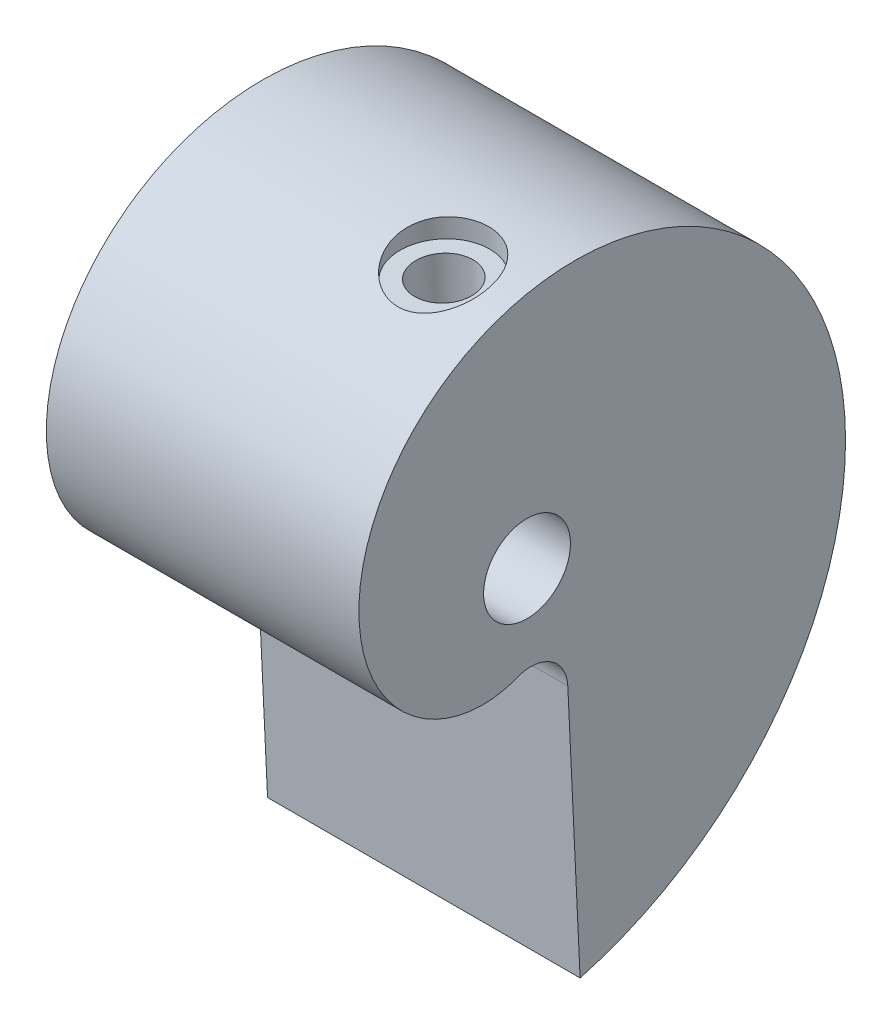
ISO-10303-21;
HEADER;
FILE_DESCRIPTION(('STEP AP214'),'2;1');
FILE_NAME('part.step','',(''),(''),'','','');
FILE_SCHEMA(('AUTOMOTIVE_DESIGN { 1 0 10303 214 1 1 1 1 }'));
ENDSEC;
DATA;
#1=APPLICATION_CONTEXT('core data for automotive mechanical design processes');
#2=APPLICATION_PROTOCOL_DEFINITION('international standard','automotive_design',2000,#1);
#3=PRODUCT_CONTEXT('',#1,'mechanical');
#4=PRODUCT('Part','Part','',(#3));
#5=PRODUCT_RELATED_PRODUCT_CATEGORY('part','',(#4));
#6=PRODUCT_DEFINITION_FORMATION('','',#4);
#7=PRODUCT_DEFINITION_CONTEXT('part definition',#1,'design');
#8=PRODUCT_DEFINITION('design','',#6,#7);
#9=PRODUCT_DEFINITION_SHAPE('','',#8);
#10=(LENGTH_UNIT() NAMED_UNIT(*) SI_UNIT(.MILLI.,.METRE.));
#11=(NAMED_UNIT(*) PLANE_ANGLE_UNIT() SI_UNIT($,.RADIAN.));
#12=(NAMED_UNIT(*) SI_UNIT($,.STERADIAN.) SOLID_ANGLE_UNIT());
#13=UNCERTAINTY_MEASURE_WITH_UNIT(LENGTH_MEASURE(1.E-05),#10,'distance_accuracy_value','');
#14=(GEOMETRIC_REPRESENTATION_CONTEXT(3) GLOBAL_UNCERTAINTY_ASSIGNED_CONTEXT((#13)) GLOBAL_UNIT_ASSIGNED_CONTEXT((#10,
#11,#12)) REPRESENTATION_CONTEXT('',''));
#15=CARTESIAN_POINT('',(0.,0.,0.));
#16=DIRECTION('',(0.,0.,1.));
#17=DIRECTION('',(1.,0.,0.));
#18=AXIS2_PLACEMENT_3D('',#15,#16,#17);
#19=CARTESIAN_POINT('',(21.59,16.3980040897592,0.208936694079273));
#20=DIRECTION('',(1.,0.,0.));
#21=DIRECTION('',(0.,0.,-1.));
#22=AXIS2_PLACEMENT_3D('',#19,#20,#21);
#23=PLANE('',#22);
#24=CARTESIAN_POINT('',(21.59,-26.3254834999288,-3.66701312597946));
#25=CARTESIAN_POINT('',(21.59,-25.8850164099486,-5.29183143138332));
#26=CARTESIAN_POINT('',(21.59,-25.2937709802203,-6.85500985861185));
#27=CARTESIAN_POINT('',(21.59,-23.8451939849136,-9.80629411018198));
#28=CARTESIAN_POINT('',(21.59,-22.9879265697091,-11.1943493778112));
#29=CARTESIAN_POINT('',(21.59,-21.0514010056648,-13.7523524342122));
#30=CARTESIAN_POINT('',(21.59,-19.9722145165317,-14.9222640436458));
#31=CARTESIAN_POINT('',(21.59,-17.6424148443339,-17.0111362692066));
#32=CARTESIAN_POINT('',(21.59,-16.3918777440894,-17.9300760548234));
#33=CARTESIAN_POINT('',(21.59,-13.774181132005,-19.4952108297215));
#34=CARTESIAN_POINT('',(21.59,-12.4070989510175,-20.1414006679111));
#35=CARTESIAN_POINT('',(21.59,-9.61304301680638,-21.1506818581234));
#36=CARTESIAN_POINT('',(21.59,-8.18614470800054,-21.5137834309209));
#37=CARTESIAN_POINT('',(21.59,-5.3288100875924,-21.9578966574969));
#38=CARTESIAN_POINT('',(21.59,-3.8984443651538,-22.038932986476));
#39=CARTESIAN_POINT('',(21.59,-1.08794928189315,-21.9307589450492));
#40=CARTESIAN_POINT('',(21.59,0.292117032528461,-21.7415862291151));
#41=CARTESIAN_POINT('',(21.59,2.95283289615589,-21.1147307327981));
#42=CARTESIAN_POINT('',(21.59,4.23342924609723,-20.6770966268396));
#43=CARTESIAN_POINT('',(21.59,6.65237105198453,-19.5836453555955));
#44=CARTESIAN_POINT('',(21.59,7.79067499289227,-18.9278855327687));
#45=CARTESIAN_POINT('',(21.59,9.88997156551444,-17.4355003933537));
#46=CARTESIAN_POINT('',(21.59,10.8509356728284,-16.5989384482919));
#47=CARTESIAN_POINT('',(21.59,12.5693210600784,-14.7874359048066));
#48=CARTESIAN_POINT('',(21.59,13.3267275415238,-13.8125618959728));
#49=CARTESIAN_POINT('',(21.59,14.6212472227952,-11.7701307863269));
#50=CARTESIAN_POINT('',(21.59,15.1583594978757,-10.7026406297588));
#51=CARTESIAN_POINT('',(21.59,16.0052572395325,-8.52186727257846));
#52=CARTESIAN_POINT('',(21.59,16.3150552236039,-7.40864857435838));
#53=CARTESIAN_POINT('',(21.59,16.7098316537026,-5.1825201174866));
#54=CARTESIAN_POINT('',(21.59,16.7948350803545,-4.06966980389498));
#55=CARTESIAN_POINT('',(21.59,16.7515036458065,-1.88772278855217));
#56=CARTESIAN_POINT('',(21.59,16.6232047553048,-0.818678144435623));
#57=CARTESIAN_POINT('',(21.59,16.1728034242135,1.23655153259428));
#58=CARTESIAN_POINT('',(21.59,15.8507460504129,2.22269384951727));
#59=CARTESIAN_POINT('',(21.59,15.0391926205608,4.07878041726697));
#60=CARTESIAN_POINT('',(21.59,14.5497485015278,4.94869279896394));
#61=CARTESIAN_POINT('',(21.59,13.4351525169527,6.5458728071125));
#62=CARTESIAN_POINT('',(21.59,12.8100570020662,7.27312041446994));
#63=CARTESIAN_POINT('',(21.59,11.4596211058448,8.56619770795014));
#64=CARTESIAN_POINT('',(21.59,10.7343389103516,9.13201969506656));
#65=CARTESIAN_POINT('',(21.59,8.46432492032774,10.5713349527582));
#66=CARTESIAN_POINT('',(21.59,6.82631034463374,11.1827796887629));
#67=CARTESIAN_POINT('',(21.59,3.59680348317033,11.7204279571445));
#68=CARTESIAN_POINT('',(21.59,2.00685947245538,11.6474809761802));
#69=CARTESIAN_POINT('',(21.59,-0.874358563474903,10.9424993264994));
#70=CARTESIAN_POINT('',(21.59,-2.16461256267651,10.3118298030999));
#71=CARTESIAN_POINT('',(21.59,-4.28109326467022,8.69840573541426));
#72=CARTESIAN_POINT('',(21.59,-5.10697539238301,7.71726162806799));
#73=CARTESIAN_POINT('',(21.59,-6.23707693613607,5.64499605846387));
#74=CARTESIAN_POINT('',(21.59,-6.54165034000696,4.55542957813348));
#75=CARTESIAN_POINT('',(21.59,-6.67904709626705,2.49487199667444));
#76=CARTESIAN_POINT('',(21.59,-6.51282232630776,1.52510200770759));
#77=CARTESIAN_POINT('',(21.59,-6.17940617515592,0.700777065763977));
#78=B_SPLINE_CURVE_WITH_KNOTS('',3,(#24,#25,#26,#27,#28,#29,#30,#31,#32,#33,#34,#35,#36,#37,#38,
#39,#40,#41,#42,#43,#44,#45,#46,#47,#48,#49,#50,#51,#52,#53,#54,#55,#56,#57,#58,#59,#60,#61,#62,
#63,#64,#65,#66,#67,#68,#69,#70,#71,#72,#73,#74,#75,#76,#77),.UNSPECIFIED.,.F.,.F.,(4,2,2,2,2,2,
2,2,2,2,2,2,2,2,2,2,2,2,2,2,2,2,2,2,2,2,4),(0.,0.0312500000000001,0.0625000000000001,
0.0937500000000002,0.125,0.15625,0.1875,0.218750000000001,0.250000000000001,0.281250000000001,
0.312500000000001,0.343750000000001,0.375000000000001,0.406250000000001,0.437500000000001,
0.468750000000001,0.500000000000001,0.53125,0.5625,0.59375,0.625,0.6875,0.75,0.8125,0.875,
0.9375,1.),.UNSPECIFIED.);
#79=CARTESIAN_POINT('',(21.59,-26.3254834999288,-3.66701312597946));
#80=VERTEX_POINT('',#79);
#81=CARTESIAN_POINT('',(21.59,-6.17940617515592,0.700777065763977));
#82=VERTEX_POINT('',#81);
#83=EDGE_CURVE('E98',#80,#82,#78,.T.);
#84=ORIENTED_EDGE('',*,*,#83,.T.);
#85=CARTESIAN_POINT('',(21.59,-8.55278837318837,-0.259188983321581));
#86=DIRECTION('',(-1.,0.,0.));
#87=DIRECTION('',(0.,0.,-1.));
#88=AXIS2_PLACEMENT_3D('',#85,#86,#87);
#89=CIRCLE('',#88,2.56017145389411);
#90=CARTESIAN_POINT('',(21.59,-8.4312368938815,-2.81647330682036));
#91=VERTEX_POINT('',#90);
#92=EDGE_CURVE('E94',#82,#91,#89,.T.);
#93=ORIENTED_EDGE('',*,*,#92,.T.);
#94=DIRECTION('',(0.,-0.998872290216758,-0.0474778668131734));
#95=VECTOR('',#94,1.);
#96=CARTESIAN_POINT('',(21.59,-26.3254834999288,-3.66701312597946));
#97=LINE('',#96,#95);
#98=EDGE_CURVE('E74',#91,#80,#97,.T.);
#99=ORIENTED_EDGE('',*,*,#98,.T.);
#100=EDGE_LOOP('',(#84,#93,#99));
#101=FACE_BOUND('',#100,.T.);
#102=CARTESIAN_POINT('',(21.59,0.,0.));
#103=DIRECTION('',(1.,0.,0.));
#104=DIRECTION('',(0.,0.,-1.));
#105=AXIS2_PLACEMENT_3D('',#102,#103,#104);
#106=CIRCLE('',#105,3.);
#107=CARTESIAN_POINT('',(21.59,0.,-3.));
#108=VERTEX_POINT('',#107);
#109=EDGE_CURVE('E107',#108,#108,#106,.T.);
#110=ORIENTED_EDGE('',*,*,#109,.F.);
#111=EDGE_LOOP('',(#110));
#112=FACE_BOUND('',#111,.T.);
#113=ADVANCED_FACE('F49',(#101,#112),#23,.T.);
#114=CARTESIAN_POINT('',(0.,16.3980040897592,0.208936694079273));
#115=DIRECTION('',(1.,0.,0.));
#116=DIRECTION('',(0.,0.,-1.));
#117=AXIS2_PLACEMENT_3D('',#114,#115,#116);
#118=PLANE('',#117);
#119=CARTESIAN_POINT('',(0.,-26.3254834999288,-3.66701312597946));
#120=CARTESIAN_POINT('',(0.,-25.8850164099486,-5.29183143138332));
#121=CARTESIAN_POINT('',(0.,-25.2937709802203,-6.85500985861185));
#122=CARTESIAN_POINT('',(0.,-23.8451939849136,-9.80629411018198));
#123=CARTESIAN_POINT('',(0.,-22.9879265697091,-11.1943493778112));
#124=CARTESIAN_POINT('',(0.,-21.0514010056648,-13.7523524342122));
#125=CARTESIAN_POINT('',(0.,-19.9722145165317,-14.9222640436458));
#126=CARTESIAN_POINT('',(0.,-17.6424148443339,-17.0111362692066));
#127=CARTESIAN_POINT('',(0.,-16.3918777440894,-17.9300760548234));
#128=CARTESIAN_POINT('',(0.,-13.774181132005,-19.4952108297215));
#129=CARTESIAN_POINT('',(0.,-12.4070989510175,-20.1414006679111));
#130=CARTESIAN_POINT('',(0.,-9.61304301680638,-21.1506818581234));
#131=CARTESIAN_POINT('',(0.,-8.18614470800054,-21.5137834309209));
#132=CARTESIAN_POINT('',(0.,-5.3288100875924,-21.9578966574969));
#133=CARTESIAN_POINT('',(0.,-3.8984443651538,-22.038932986476));
#134=CARTESIAN_POINT('',(0.,-1.08794928189315,-21.9307589450492));
#135=CARTESIAN_POINT('',(0.,0.292117032528461,-21.7415862291151));
#136=CARTESIAN_POINT('',(0.,2.95283289615589,-21.1147307327981));
#137=CARTESIAN_POINT('',(0.,4.23342924609723,-20.6770966268396));
#138=CARTESIAN_POINT('',(0.,6.65237105198453,-19.5836453555955));
#139=CARTESIAN_POINT('',(0.,7.79067499289227,-18.9278855327687));
#140=CARTESIAN_POINT('',(0.,9.88997156551444,-17.4355003933537));
#141=CARTESIAN_POINT('',(0.,10.8509356728284,-16.5989384482919));
#142=CARTESIAN_POINT('',(0.,12.5693210600784,-14.7874359048066));
#143=CARTESIAN_POINT('',(0.,13.3267275415238,-13.8125618959728));
#144=CARTESIAN_POINT('',(0.,14.6212472227952,-11.7701307863269));
#145=CARTESIAN_POINT('',(0.,15.1583594978757,-10.7026406297588));
#146=CARTESIAN_POINT('',(0.,16.0052572395325,-8.52186727257846));
#147=CARTESIAN_POINT('',(0.,16.3150552236039,-7.40864857435838));
#148=CARTESIAN_POINT('',(0.,16.7098316537026,-5.1825201174866));
#149=CARTESIAN_POINT('',(0.,16.7948350803545,-4.06966980389498));
#150=CARTESIAN_POINT('',(0.,16.7515036458065,-1.88772278855217));
#151=CARTESIAN_POINT('',(0.,16.6232047553048,-0.818678144435623));
#152=CARTESIAN_POINT('',(0.,16.1728034242135,1.23655153259428));
#153=CARTESIAN_POINT('',(0.,15.8507460504129,2.22269384951727));
#154=CARTESIAN_POINT('',(0.,15.0391926205608,4.07878041726697));
#155=CARTESIAN_POINT('',(0.,14.5497485015278,4.94869279896394));
#156=CARTESIAN_POINT('',(0.,13.4351525169527,6.5458728071125));
#157=CARTESIAN_POINT('',(0.,12.8100570020662,7.27312041446994));
#158=CARTESIAN_POINT('',(0.,11.4596211058448,8.56619770795014));
#159=CARTESIAN_POINT('',(0.,10.7343389103516,9.13201969506656));
#160=CARTESIAN_POINT('',(0.,8.46432492032774,10.5713349527582));
#161=CARTESIAN_POINT('',(0.,6.82631034463374,11.1827796887629));
#162=CARTESIAN_POINT('',(0.,3.59680348317033,11.7204279571445));
#163=CARTESIAN_POINT('',(0.,2.00685947245538,11.6474809761802));
#164=CARTESIAN_POINT('',(0.,-0.874358563474903,10.9424993264994));
#165=CARTESIAN_POINT('',(0.,-2.16461256267651,10.3118298030999));
#166=CARTESIAN_POINT('',(0.,-4.28109326467022,8.69840573541426));
#167=CARTESIAN_POINT('',(0.,-5.10697539238301,7.71726162806799));
#168=CARTESIAN_POINT('',(0.,-6.23707693613607,5.64499605846387));
#169=CARTESIAN_POINT('',(0.,-6.54165034000696,4.55542957813348));
#170=CARTESIAN_POINT('',(0.,-6.67904709626705,2.49487199667444));
#171=CARTESIAN_POINT('',(0.,-6.51282232630776,1.52510200770759));
#172=CARTESIAN_POINT('',(0.,-6.17940617515592,0.700777065763977));
#173=B_SPLINE_CURVE_WITH_KNOTS('',3,(#119,#120,#121,#122,#123,#124,#125,#126,#127,#128,#129,
#130,#131,#132,#133,#134,#135,#136,#137,#138,#139,#140,#141,#142,#143,#144,#145,#146,#147,#148,
#149,#150,#151,#152,#153,#154,#155,#156,#157,#158,#159,#160,#161,#162,#163,#164,#165,#166,#167,
#168,#169,#170,#171,#172),.UNSPECIFIED.,.F.,.F.,(4,2,2,2,2,2,2,2,2,2,2,2,2,2,2,2,2,2,2,2,2,2,2,
2,2,2,4),(0.,0.0312500000000001,0.0625000000000001,0.0937500000000002,0.125,0.15625,0.1875,
0.218750000000001,0.250000000000001,0.281250000000001,0.312500000000001,0.343750000000001,
0.375000000000001,0.406250000000001,0.437500000000001,0.468750000000001,0.500000000000001,
0.53125,0.5625,0.59375,0.625,0.6875,0.75,0.8125,0.875,0.9375,1.),.UNSPECIFIED.);
#174=CARTESIAN_POINT('',(0.,-26.3254834999288,-3.66701312597946));
#175=VERTEX_POINT('',#174);
#176=CARTESIAN_POINT('',(0.,-6.17940617515592,0.700777065763977));
#177=VERTEX_POINT('',#176);
#178=EDGE_CURVE('E104',#175,#177,#173,.T.);
#179=ORIENTED_EDGE('',*,*,#178,.F.);
#180=DIRECTION('',(0.,-0.998872290216758,-0.0474778668131734));
#181=VECTOR('',#180,1.);
#182=CARTESIAN_POINT('',(0.,-26.3254834999288,-3.66701312597946));
#183=LINE('',#182,#181);
#184=CARTESIAN_POINT('',(0.,-8.4312368938815,-2.81647330682036));
#185=VERTEX_POINT('',#184);
#186=EDGE_CURVE('E91',#185,#175,#183,.T.);
#187=ORIENTED_EDGE('',*,*,#186,.F.);
#188=CARTESIAN_POINT('',(0.,-8.55278837318837,-0.259188983321581));
#189=DIRECTION('',(-1.,0.,0.));
#190=DIRECTION('',(0.,0.,-1.));
#191=AXIS2_PLACEMENT_3D('',#188,#189,#190);
#192=CIRCLE('',#191,2.56017145389411);
#193=EDGE_CURVE('E86',#177,#185,#192,.T.);
#194=ORIENTED_EDGE('',*,*,#193,.F.);
#195=EDGE_LOOP('',(#179,#187,#194));
#196=FACE_BOUND('',#195,.T.);
#197=CARTESIAN_POINT('',(0.,0.,0.));
#198=DIRECTION('',(1.,0.,0.));
#199=DIRECTION('',(0.,0.,-1.));
#200=AXIS2_PLACEMENT_3D('',#197,#198,#199);
#201=CIRCLE('',#200,3.);
#202=CARTESIAN_POINT('',(0.,0.,-3.));
#203=VERTEX_POINT('',#202);
#204=EDGE_CURVE('E111',#203,#203,#201,.T.);
#205=ORIENTED_EDGE('',*,*,#204,.T.);
#206=EDGE_LOOP('',(#205));
#207=FACE_BOUND('',#206,.T.);
#208=ADVANCED_FACE('F142',(#196,#207),#118,.F.);
#209=DIRECTION('',(-1.,0.,0.));
#210=VECTOR('',#209,1.);
#211=SURFACE_OF_LINEAR_EXTRUSION('',#78,#210);
#212=CARTESIAN_POINT('',(16.565,16.7506396740937,-2.38240201858189));
#213=CARTESIAN_POINT('',(16.7433125657749,16.7506413895993,-2.38239572343409));
#214=CARTESIAN_POINT('',(16.9217084574211,16.749821870359,-2.36735698221768));
#215=CARTESIAN_POINT('',(17.2735404531971,16.7463257784659,-2.30760094349494));
#216=CARTESIAN_POINT('',(17.4469725353157,16.7436477419284,-2.26286025207603));
#217=CARTESIAN_POINT('',(17.7838175619757,16.7358008377302,-2.14500470832748));
#218=CARTESIAN_POINT('',(17.9472329710051,16.7306325855541,-2.07189686812296));
#219=CARTESIAN_POINT('',(18.2593967109722,16.7168613322798,-1.89946022909936));
#220=CARTESIAN_POINT('',(18.4081474456539,16.7082588952634,-1.80013573740177));
#221=CARTESIAN_POINT('',(18.6865194273289,16.6865245866847,-1.57839471352308));
#222=CARTESIAN_POINT('',(18.816172777858,16.6734004432769,-1.45601774158622));
#223=CARTESIAN_POINT('',(19.0529395131531,16.6415294219983,-1.19174783860988));
#224=CARTESIAN_POINT('',(19.1600538561791,16.6227827832536,-1.04985573769259));
#225=CARTESIAN_POINT('',(19.348142330831,16.5789328491663,-0.751848833363511));
#226=CARTESIAN_POINT('',(19.4292768024721,16.5538703203621,-0.595829205294695));
#227=CARTESIAN_POINT('',(19.5642185684297,16.4968714939526,-0.273578315973267));
#228=CARTESIAN_POINT('',(19.6180270069779,16.4649354842426,-0.107347482624563));
#229=CARTESIAN_POINT('',(19.6971716405541,16.394258927079,0.23027529592253));
#230=CARTESIAN_POINT('',(19.722518372012,16.3555209038536,0.401665307067589));
#231=CARTESIAN_POINT('',(19.744621054064,16.2718922700363,0.74477200769912));
#232=CARTESIAN_POINT('',(19.7413740122333,16.2270010159743,0.916488729496723));
#233=CARTESIAN_POINT('',(19.7065779354297,16.131231758128,1.25944455369324));
#234=CARTESIAN_POINT('',(19.6744043268891,16.0802432751121,1.43058903606567));
#235=CARTESIAN_POINT('',(19.5822767862168,15.9748963486612,1.76413828861456));
#236=CARTESIAN_POINT('',(19.5223164634281,15.9205371324849,1.92654103868751));
#237=CARTESIAN_POINT('',(19.37349122948,15.8084495214842,2.24504073687003));
#238=CARTESIAN_POINT('',(19.2835681169074,15.7506732515505,2.40062724447312));
#239=CARTESIAN_POINT('',(19.0779746661179,15.6367051121502,2.69441582491913));
#240=CARTESIAN_POINT('',(18.9622977115638,15.5805136540196,2.83261341612553));
#241=CARTESIAN_POINT('',(18.7052597507176,15.4718331439367,3.09055875271198));
#242=CARTESIAN_POINT('',(18.563448220764,15.4194359017119,3.20990127896187));
#243=CARTESIAN_POINT('',(18.3354405886196,15.3473231379403,3.3696794962394));
#244=CARTESIAN_POINT('',(18.2568465828785,15.324356219765,3.419753165804));
#245=CARTESIAN_POINT('',(18.0950375543645,15.2810258558235,3.51306824531798));
#246=CARTESIAN_POINT('',(18.0118248362869,15.2606611280454,3.55631302212939));
#247=CARTESIAN_POINT('',(17.8449506674736,15.2237661173167,3.63386819559383));
#248=CARTESIAN_POINT('',(17.7614559986682,15.2071103843645,3.66847836816939));
#249=CARTESIAN_POINT('',(17.5913768396874,15.1769484403086,3.73067224852883));
#250=CARTESIAN_POINT('',(17.5047938330402,15.1634407398821,3.75825927950836));
#251=CARTESIAN_POINT('',(17.3291969657523,15.1398794833412,3.80610837444833));
#252=CARTESIAN_POINT('',(17.2401839282174,15.1298247729152,3.82637288639648));
#253=CARTESIAN_POINT('',(17.0604349726318,15.113407621694,3.85934439959767));
#254=CARTESIAN_POINT('',(16.9696991833952,15.1070449059538,3.87205196362262));
#255=CARTESIAN_POINT('',(16.79455331826,15.0985240892335,3.88904578045354));
#256=CARTESIAN_POINT('',(16.7102142050666,15.0960717840662,3.89392151576271));
#257=CARTESIAN_POINT('',(16.5413523279664,15.0944819837441,3.89708380613252));
#258=CARTESIAN_POINT('',(16.4568295124437,15.0953455878203,3.89536817614142));
#259=CARTESIAN_POINT('',(16.2883132554156,15.1003719089667,3.88536114739973));
#260=CARTESIAN_POINT('',(16.2043195602008,15.1045329006177,3.87707318774104));
#261=CARTESIAN_POINT('',(16.0374380848698,15.1160570440926,3.85402351718646));
#262=CARTESIAN_POINT('',(15.9545507303056,15.1234213934655,3.83925938520938));
#263=CARTESIAN_POINT('',(15.7135282259701,15.1495616401689,3.78655914799319));
#264=CARTESIAN_POINT('',(15.5576580863421,15.1725644974324,3.73987333526958));
#265=CARTESIAN_POINT('',(15.2563374938122,15.2283883617697,3.6243856032296));
#266=CARTESIAN_POINT('',(15.1108890695337,15.2612112739511,3.55557939232458));
#267=CARTESIAN_POINT('',(14.8265360489511,15.3363613688962,3.39404776600376));
#268=CARTESIAN_POINT('',(14.6883111815686,15.3790784167601,3.30030741267247));
#269=CARTESIAN_POINT('',(14.4294546693891,15.4703504029779,3.09340467821784));
#270=CARTESIAN_POINT('',(14.3088294301683,15.5189074551929,2.98023525813181));
#271=CARTESIAN_POINT('',(14.0789724060991,15.6231462990422,2.72781772189997));
#272=CARTESIAN_POINT('',(13.9713199073631,15.6790889471381,2.58723636566584));
#273=CARTESIAN_POINT('',(13.7815053033552,15.7918180971415,2.29008118723744));
#274=CARTESIAN_POINT('',(13.6993495787082,15.8486048065575,2.13350337490384));
#275=CARTESIAN_POINT('',(13.5602533042469,15.9623970325448,1.80219910865936));
#276=CARTESIAN_POINT('',(13.504326409703,16.0193369007987,1.62702235329759));
#277=CARTESIAN_POINT('',(13.4242595372715,16.1287696936005,1.26820289867208));
#278=CARTESIAN_POINT('',(13.4001155032531,16.1812631847952,1.0845612827911));
#279=CARTESIAN_POINT('',(13.385193870193,16.2787719932153,0.718254653214319));
#280=CARTESIAN_POINT('',(13.3936966228172,16.3239259866846,0.53565643838068));
#281=CARTESIAN_POINT('',(13.4429083099938,16.4069046087537,0.173155051099132));
#282=CARTESIAN_POINT('',(13.4836093005975,16.4447310423436,-0.00674877495434841));
#283=CARTESIAN_POINT('',(13.5942352875637,16.5112585207308,-0.350944470852365));
#284=CARTESIAN_POINT('',(13.662934134937,16.540262566406,-0.515572664111018));
#285=CARTESIAN_POINT('',(13.8276352586509,16.5913323509495,-0.831717074035169));
#286=CARTESIAN_POINT('',(13.9236341626166,16.6133989460922,-0.983234907209561));
#287=CARTESIAN_POINT('',(14.1382408076017,16.6509650936835,-1.26576374035269));
#288=CARTESIAN_POINT('',(14.2564004615726,16.6665779170517,-1.39710052998256));
#289=CARTESIAN_POINT('',(14.5131439312932,16.692803887894,-1.63864995249749));
#290=CARTESIAN_POINT('',(14.6517311068004,16.7034162117182,-1.74885910360258));
#291=CARTESIAN_POINT('',(14.9458446839421,16.7207600224453,-1.9451849781874));
#292=CARTESIAN_POINT('',(15.1014212227302,16.7274796324812,-2.03122756112737));
#293=CARTESIAN_POINT('',(15.4247138575761,16.7380174528368,-2.17622583051713));
#294=CARTESIAN_POINT('',(15.592420784005,16.7418378301567,-2.23520173460522));
#295=CARTESIAN_POINT('',(15.8944508944589,16.7467084225449,-2.31383530128008));
#296=CARTESIAN_POINT('',(16.0272363012907,16.7482011961144,-2.33950607055206));
#297=CARTESIAN_POINT('',(16.2949985372011,16.7501661752923,-2.37379186153075));
#298=CARTESIAN_POINT('',(16.429975378834,16.7506383750518,-2.38240678549186));
#299=CARTESIAN_POINT('',(16.565,16.7506396740937,-2.38240201858189));
#300=B_SPLINE_CURVE_WITH_KNOTS('',3,(#212,#213,#214,#215,#216,#217,#218,#219,#220,#221,#222,
#223,#224,#225,#226,#227,#228,#229,#230,#231,#232,#233,#234,#235,#236,#237,#238,#239,#240,#241,
#242,#243,#244,#245,#246,#247,#248,#249,#250,#251,#252,#253,#254,#255,#256,#257,#258,#259,#260,
#261,#262,#263,#264,#265,#266,#267,#268,#269,#270,#271,#272,#273,#274,#275,#276,#277,#278,#279,
#280,#281,#282,#283,#284,#285,#286,#287,#288,#289,#290,#291,#292,#293,#294,#295,#296,#297,#298,
#299),.UNSPECIFIED.,.T.,.F.,(4,2,2,2,2,2,2,2,2,2,2,2,2,2,2,2,2,2,2,2,2,2,2,2,2,2,2,2,2,2,2,2,2,
2,2,2,2,2,2,2,2,2,2,4),(0.,0.534451645894367,1.06932473792822,1.60406569789057,2.13871886013215,
2.67246273028415,3.2061839033957,3.73654461265796,4.26688311212229,4.79702521723493,
5.32722280398093,5.86915066299671,6.41120322172103,6.97489189795413,7.5387255570959,
8.11338569897889,8.40100316382573,8.6884783783365,8.96383534701767,9.23906177966751,
9.51419611619283,9.78930996067973,10.0425392195921,10.295852431789,10.5490331806023,
10.8023086604135,11.2929022099079,11.7835909971805,12.2985553916675,12.8137067479945,
13.3682975128205,13.9230269535227,14.497716588367,15.0723328741687,15.6343561150362,
16.1962407367653,16.7357872484509,17.2752671389078,17.8048292042514,18.3344784651681,
18.8657353155608,19.3965946916137,19.8012981803549,20.2060039884107),.UNSPECIFIED.);
#301=CARTESIAN_POINT('',(16.565,16.7506396740937,-2.38240201858189));
#302=VERTEX_POINT('',#301);
#303=EDGE_CURVE('E122',#302,#302,#300,.T.);
#304=ORIENTED_EDGE('',*,*,#303,.T.);
#305=EDGE_LOOP('',(#304));
#306=FACE_BOUND('',#305,.T.);
#307=ORIENTED_EDGE('',*,*,#178,.T.);
#308=DIRECTION('',(-1.,0.,0.));
#309=VECTOR('',#308,1.);
#310=CARTESIAN_POINT('',(21.59,-6.17940617515592,0.700777065763977));
#311=LINE('',#310,#309);
#312=EDGE_CURVE('E13',#82,#177,#311,.T.);
#313=ORIENTED_EDGE('',*,*,#312,.F.);
#314=ORIENTED_EDGE('',*,*,#83,.F.);
#315=DIRECTION('',(-1.,0.,0.));
#316=VECTOR('',#315,1.);
#317=CARTESIAN_POINT('',(21.59,-26.3254834999288,-3.66701312597946));
#318=LINE('',#317,#316);
#319=EDGE_CURVE('E105',#80,#175,#318,.T.);
#320=ORIENTED_EDGE('',*,*,#319,.T.);
#321=EDGE_LOOP('',(#307,#313,#314,#320));
#322=FACE_BOUND('',#321,.T.);
#323=ADVANCED_FACE('F51',(#306,#322),#211,.F.);
#324=CARTESIAN_POINT('',(21.59,-8.55278837318837,-0.259188983321581));
#325=DIRECTION('',(-1.,0.,0.));
#326=DIRECTION('',(0.,0.,1.));
#327=AXIS2_PLACEMENT_3D('',#324,#325,#326);
#328=CYLINDRICAL_SURFACE('',#327,2.56017145389411);
#329=ORIENTED_EDGE('',*,*,#193,.T.);
#330=DIRECTION('',(-1.,0.,0.));
#331=VECTOR('',#330,1.);
#332=CARTESIAN_POINT('',(21.59,-8.4312368938815,-2.81647330682036));
#333=LINE('',#332,#331);
#334=EDGE_CURVE('E65',#91,#185,#333,.T.);
#335=ORIENTED_EDGE('',*,*,#334,.F.);
#336=ORIENTED_EDGE('',*,*,#92,.F.);
#337=ORIENTED_EDGE('',*,*,#312,.T.);
#338=EDGE_LOOP('',(#329,#335,#336,#337));
#339=FACE_BOUND('',#338,.T.);
#340=ADVANCED_FACE('F95',(#339),#328,.F.);
#341=CARTESIAN_POINT('',(21.59,-26.3254834999288,-3.66701312597946));
#342=DIRECTION('',(0.,0.0474778668131734,-0.998872290216758));
#343=DIRECTION('',(0.,0.998872290216758,0.0474778668131734));
#344=AXIS2_PLACEMENT_3D('',#341,#342,#343);
#345=PLANE('',#344);
#346=ORIENTED_EDGE('',*,*,#186,.T.);
#347=ORIENTED_EDGE('',*,*,#319,.F.);
#348=ORIENTED_EDGE('',*,*,#98,.F.);
#349=ORIENTED_EDGE('',*,*,#334,.T.);
#350=EDGE_LOOP('',(#346,#347,#348,#349));
#351=FACE_BOUND('',#350,.T.);
#352=ADVANCED_FACE('F138',(#351),#345,.F.);
#353=CARTESIAN_POINT('',(21.59,0.,0.));
#354=DIRECTION('',(-1.,0.,0.));
#355=DIRECTION('',(0.,0.,1.));
#356=AXIS2_PLACEMENT_3D('',#353,#354,#355);
#357=CYLINDRICAL_SURFACE('',#356,3.);
#358=CARTESIAN_POINT('',(16.565,2.12028038204539,2.12235979549027));
#359=CARTESIAN_POINT('',(16.4667328598408,2.12028848918387,2.12235574640076));
#360=CARTESIAN_POINT('',(16.3684396592825,2.1272670071276,2.11544854411303));
#361=CARTESIAN_POINT('',(16.1753956042412,2.15382911691391,2.08838492945829));
#362=CARTESIAN_POINT('',(16.0806515368345,2.17343567338187,2.06820437751953));
#363=CARTESIAN_POINT('',(15.898115540295,2.22182310173142,2.01611940184166));
#364=CARTESIAN_POINT('',(15.8102646347584,2.25051228608712,1.98433167860404));
#365=CARTESIAN_POINT('',(15.641517994946,2.31379446378661,1.91016493745002));
#366=CARTESIAN_POINT('',(15.5606235348317,2.34838853523675,1.86778398477872));
#367=CARTESIAN_POINT('',(15.3939764145017,2.42634419581015,1.76567376420376));
#368=CARTESIAN_POINT('',(15.3095005764119,2.47022479874889,1.70425677328391));
#369=CARTESIAN_POINT('',(15.1512681262757,2.55831415648357,1.56893677481746));
#370=CARTESIAN_POINT('',(15.0775234546584,2.60252322014981,1.49502005366528));
#371=CARTESIAN_POINT('',(14.9319381685596,2.69434111659312,1.32338517364023));
#372=CARTESIAN_POINT('',(14.8620133455484,2.74147712399974,1.22376200962438));
#373=CARTESIAN_POINT('',(14.74092456293,2.82705144975862,1.01040221396569));
#374=CARTESIAN_POINT('',(14.6897263388148,2.86550560364039,0.896691873719948));
#375=CARTESIAN_POINT('',(14.6194406320562,2.92138993541408,0.688486460837517));
#376=CARTESIAN_POINT('',(14.5955107790667,2.94167661806749,0.596380838870983));
#377=CARTESIAN_POINT('',(14.5610706488714,2.97361755963886,0.408255826934818));
#378=CARTESIAN_POINT('',(14.5505501907331,2.9852783648312,0.312239463380161));
#379=CARTESIAN_POINT('',(14.5435070950218,2.99921453700448,0.118857670982175));
#380=CARTESIAN_POINT('',(14.5470072123757,3.00147463482578,0.0214903048783748));
#381=CARTESIAN_POINT('',(14.5678489053777,2.99664936371328,-0.17151864443503));
#382=CARTESIAN_POINT('',(14.5851945804805,2.98956122650674,-0.267159707935345));
#383=CARTESIAN_POINT('',(14.6323848829118,2.96712722760512,-0.452468583282783));
#384=CARTESIAN_POINT('',(14.6620100738361,2.95192505613619,-0.542210701604359));
#385=CARTESIAN_POINT('',(14.7324642390206,2.91474396742281,-0.715642458400003));
#386=CARTESIAN_POINT('',(14.7732953323774,2.89276376831946,-0.799330948314167));
#387=CARTESIAN_POINT('',(14.8700346253892,2.84090881378539,-0.968460757395492));
#388=CARTESIAN_POINT('',(14.9271235396893,2.81042345250388,-1.05303628307403));
#389=CARTESIAN_POINT('',(15.052107400767,2.74554521098295,-1.21218164141393));
#390=CARTESIAN_POINT('',(15.1200150156509,2.71114776358468,-1.28673955296214));
#391=CARTESIAN_POINT('',(15.27764346291,2.63524990882614,-1.43652944196565));
#392=CARTESIAN_POINT('',(15.3691138068383,2.59351953387313,-1.50981173568687));
#393=CARTESIAN_POINT('',(15.5641707375766,2.51308481925863,-1.64020286542295));
#394=CARTESIAN_POINT('',(15.6677497479923,2.47437861240433,-1.69732173916104));
#395=CARTESIAN_POINT('',(15.8599239808636,2.41399774725226,-1.78175338308866));
#396=CARTESIAN_POINT('',(15.9462288128377,2.39046162805908,-1.81292374997662));
#397=CARTESIAN_POINT('',(16.1239987409443,2.35152611340619,-1.8631546249348));
#398=CARTESIAN_POINT('',(16.2154541774374,2.33611201342263,-1.88223703043339));
#399=CARTESIAN_POINT('',(16.4021128112496,2.31584458356228,-1.90712969037207));
#400=CARTESIAN_POINT('',(16.4973395024567,2.31107375592379,-1.91283627813399));
#401=CARTESIAN_POINT('',(16.6874607323001,2.31329557478279,-1.91014793487933));
#402=CARTESIAN_POINT('',(16.7823552399239,2.32028929172951,-1.90175172065692));
#403=CARTESIAN_POINT('',(16.9586160296345,2.34336147118843,-1.87321469247652));
#404=CARTESIAN_POINT('',(17.0403497189188,2.35839780834755,-1.85441386383909));
#405=CARTESIAN_POINT('',(17.19949554989,2.39480473578163,-1.80715213868883));
#406=CARTESIAN_POINT('',(17.2769037521532,2.41618099187566,-1.7786825981863));
#407=CARTESIAN_POINT('',(17.4600051025368,2.47361894198719,-1.69840930630491));
#408=CARTESIAN_POINT('',(17.5629020560131,2.51197680379099,-1.64186223169712));
#409=CARTESIAN_POINT('',(17.7568810771684,2.5917721464647,-1.51277668605855));
#410=CARTESIAN_POINT('',(17.8479411400979,2.63321514396262,-1.4402090897587));
#411=CARTESIAN_POINT('',(18.0181794819501,2.71500637650003,-1.2794467788588));
#412=CARTESIAN_POINT('',(18.0971907161838,2.75533380270867,-1.1910638892513));
#413=CARTESIAN_POINT('',(18.2400039987763,2.83003944321896,-1.00064909496542));
#414=CARTESIAN_POINT('',(18.3038304372846,2.86442717330891,-0.898639495086297));
#415=CARTESIAN_POINT('',(18.4039161810089,2.91809353527471,-0.702251992225361));
#416=CARTESIAN_POINT('',(18.4430670671926,2.93897614094036,-0.609789632069121));
#417=CARTESIAN_POINT('',(18.5078362764038,2.97220570414023,-0.418767233075192));
#418=CARTESIAN_POINT('',(18.5334633325463,2.98455817166969,-0.320211175344464));
#419=CARTESIAN_POINT('',(18.5698973317487,2.99933307232094,-0.119158499306343));
#420=CARTESIAN_POINT('',(18.5806363557601,3.0017100967523,-0.0166460005023574));
#421=CARTESIAN_POINT('',(18.5863803799619,2.99582780040363,0.188515646070649));
#422=CARTESIAN_POINT('',(18.5813879793598,2.98757023684507,0.291164768464989));
#423=CARTESIAN_POINT('',(18.5569878371614,2.96196684512782,0.485408367359834));
#424=CARTESIAN_POINT('',(18.5387107864744,2.94536370839101,0.57724819333632));
#425=CARTESIAN_POINT('',(18.4899650043451,2.90466382257784,0.755860162803804));
#426=CARTESIAN_POINT('',(18.4594943206658,2.88056587369737,0.842631492262873));
#427=CARTESIAN_POINT('',(18.3856377944098,2.82493697968474,1.01404855691689));
#428=CARTESIAN_POINT('',(18.3416360099734,2.79307122568373,1.09831760125453));
#429=CARTESIAN_POINT('',(18.2429253261677,2.72476102863076,1.25827469012518));
#430=CARTESIAN_POINT('',(18.1882103677206,2.68831399873056,1.33395784027541));
#431=CARTESIAN_POINT('',(18.0598992821813,2.60701572773753,1.48732606234674));
#432=CARTESIAN_POINT('',(17.9846856967384,2.56174675585185,1.56343617799662));
#433=CARTESIAN_POINT('',(17.8228381890138,2.47141451097108,1.7026452151688));
#434=CARTESIAN_POINT('',(17.7361950427309,2.42635143485822,1.76573352109393));
#435=CARTESIAN_POINT('',(17.5581723264889,2.34321746911373,1.87449071596821));
#436=CARTESIAN_POINT('',(17.4674353636179,2.30488489975618,1.92100682772764));
#437=CARTESIAN_POINT('',(17.2775170660789,2.23609615976015,2.00066258472564));
#438=CARTESIAN_POINT('',(17.1783512964321,2.20562587302337,2.03382626405166));
#439=CARTESIAN_POINT('',(16.9937200304283,2.16196405390712,2.08007731395641));
#440=CARTESIAN_POINT('',(16.9094667801936,2.14653840678831,2.09584962228186));
#441=CARTESIAN_POINT('',(16.7384806064526,2.12569838741478,2.11698704174864));
#442=CARTESIAN_POINT('',(16.651750458181,2.12027322504481,2.12236337003583));
#443=CARTESIAN_POINT('',(16.565,2.12028038204539,2.12235979549027));
#444=B_SPLINE_CURVE_WITH_KNOTS('',3,(#358,#359,#360,#361,#362,#363,#364,#365,#366,#367,#368,
#369,#370,#371,#372,#373,#374,#375,#376,#377,#378,#379,#380,#381,#382,#383,#384,#385,#386,#387,
#388,#389,#390,#391,#392,#393,#394,#395,#396,#397,#398,#399,#400,#401,#402,#403,#404,#405,#406,
#407,#408,#409,#410,#411,#412,#413,#414,#415,#416,#417,#418,#419,#420,#421,#422,#423,#424,#425,
#426,#427,#428,#429,#430,#431,#432,#433,#434,#435,#436,#437,#438,#439,#440,#441,#442,#443),
.UNSPECIFIED.,.T.,.F.,(4,2,2,2,2,2,2,2,2,2,2,2,2,2,2,2,2,2,2,2,2,2,2,2,2,2,2,2,2,2,2,2,2,2,2,2,
2,2,2,2,2,2,4),(0.,0.294403536380051,0.589343975595897,0.881397200780214,1.17350380579788,
1.51211387476107,1.85109787614565,2.24051778682945,2.62922155934116,2.91986353918583,
3.21028472066951,3.5011774368684,3.79215631384676,4.07814540042061,4.36418860638471,
4.68247532658299,5.00113752008124,5.37279099606919,5.7442131606791,6.02735164683166,
6.3099757476852,6.59478313131646,6.8796164308116,7.13424228210731,7.38909637504133,
7.7577000588713,8.12697946404345,8.50098664778866,8.87438897473934,9.18078287749256,
9.48697868121594,9.79456680098564,10.1021041025096,10.3861411287428,10.6702236483578,
10.9698648671405,11.2696760468771,11.6168834583152,11.9643728107566,12.2899631035632,
12.6149646923712,12.8751457033016,13.1350458248448),.UNSPECIFIED.);
#445=CARTESIAN_POINT('',(16.565,2.12028038204539,2.12235979549027));
#446=VERTEX_POINT('',#445);
#447=EDGE_CURVE('E55',#446,#446,#444,.T.);
#448=ORIENTED_EDGE('',*,*,#447,.F.);
#449=EDGE_LOOP('',(#448));
#450=FACE_BOUND('',#449,.T.);
#451=ORIENTED_EDGE('',*,*,#109,.T.);
#452=EDGE_LOOP('',(#451));
#453=FACE_BOUND('',#452,.T.);
#454=ORIENTED_EDGE('',*,*,#204,.F.);
#455=EDGE_LOOP('',(#454));
#456=FACE_BOUND('',#455,.T.);
#457=ADVANCED_FACE('F133',(#450,#453,#456),#357,.F.);
#458=CARTESIAN_POINT('',(16.565,20.2970849372045,0.964750253643683));
#459=DIRECTION('',(0.,-0.998872290216758,-0.0474778668131734));
#460=DIRECTION('',(0.,0.0474778668131734,-0.998872290216758));
#461=AXIS2_PLACEMENT_3D('',#458,#459,#460);
#462=CYLINDRICAL_SURFACE('',#461,3.175);
#463=CARTESIAN_POINT('',(16.565,15.2228137029034,0.723562690232762));
#464=DIRECTION('',(0.,-0.998872290216758,-0.0474778668131734));
#465=DIRECTION('',(0.,0.0474778668131734,-0.998872290216758));
#466=AXIS2_PLACEMENT_3D('',#463,#464,#465);
#467=CIRCLE('',#466,3.175);
#468=CARTESIAN_POINT('',(16.565,15.3735559300352,-2.44785683120545));
#469=VERTEX_POINT('',#468);
#470=EDGE_CURVE('E127',#469,#469,#467,.T.);
#471=ORIENTED_EDGE('',*,*,#470,.T.);
#472=EDGE_LOOP('',(#471));
#473=FACE_BOUND('',#472,.T.);
#474=ORIENTED_EDGE('',*,*,#303,.F.);
#475=EDGE_LOOP('',(#474));
#476=FACE_BOUND('',#475,.T.);
#477=ADVANCED_FACE('F128',(#473,#476),#462,.F.);
#478=CARTESIAN_POINT('',(16.565,15.2228137029034,0.723562690232762));
#479=DIRECTION('',(0.,-0.998872290216758,-0.0474778668131734));
#480=DIRECTION('',(0.,0.0474778668131734,-0.998872290216758));
#481=AXIS2_PLACEMENT_3D('',#478,#479,#480);
#482=PLANE('',#481);
#483=CARTESIAN_POINT('',(16.565,15.2228137029034,0.723562690232762));
#484=DIRECTION('',(0.,0.998872290216758,0.0474778668131734));
#485=DIRECTION('',(0.,-0.0474778668131734,0.998872290216758));
#486=AXIS2_PLACEMENT_3D('',#483,#484,#485);
#487=CIRCLE('',#486,2.0193);
#488=CARTESIAN_POINT('',(16.565,15.1269416464476,2.74058550586746));
#489=VERTEX_POINT('',#488);
#490=EDGE_CURVE('E216',#489,#489,#487,.T.);
#491=ORIENTED_EDGE('',*,*,#490,.F.);
#492=EDGE_LOOP('',(#491));
#493=FACE_BOUND('',#492,.T.);
#494=ORIENTED_EDGE('',*,*,#470,.F.);
#495=EDGE_LOOP('',(#494));
#496=FACE_BOUND('',#495,.T.);
#497=ADVANCED_FACE('F132',(#493,#496),#482,.F.);
#498=CARTESIAN_POINT('',(16.565,15.2228137029034,0.723562690232762));
#499=DIRECTION('',(0.,0.998872290216758,0.0474778668131734));
#500=DIRECTION('',(0.,-0.0474778668131734,0.998872290216758));
#501=AXIS2_PLACEMENT_3D('',#498,#499,#500);
#502=CYLINDRICAL_SURFACE('',#501,2.0193);
#503=ORIENTED_EDGE('',*,*,#447,.T.);
#504=EDGE_LOOP('',(#503));
#505=FACE_BOUND('',#504,.T.);
#506=ORIENTED_EDGE('',*,*,#490,.T.);
#507=EDGE_LOOP('',(#506));
#508=FACE_BOUND('',#507,.T.);
#509=ADVANCED_FACE('F196',(#505,#508),#502,.F.);
#510=CLOSED_SHELL('',(#113,#208,#323,#340,#352,#457,#477,#497,#509));
#511=MANIFOLD_SOLID_BREP('B2',#510);
#512=ADVANCED_BREP_SHAPE_REPRESENTATION('',(#18,#511),#14);
#513=SHAPE_DEFINITION_REPRESENTATION(#9,#512);
ENDSEC;
END-ISO-10303-21;
